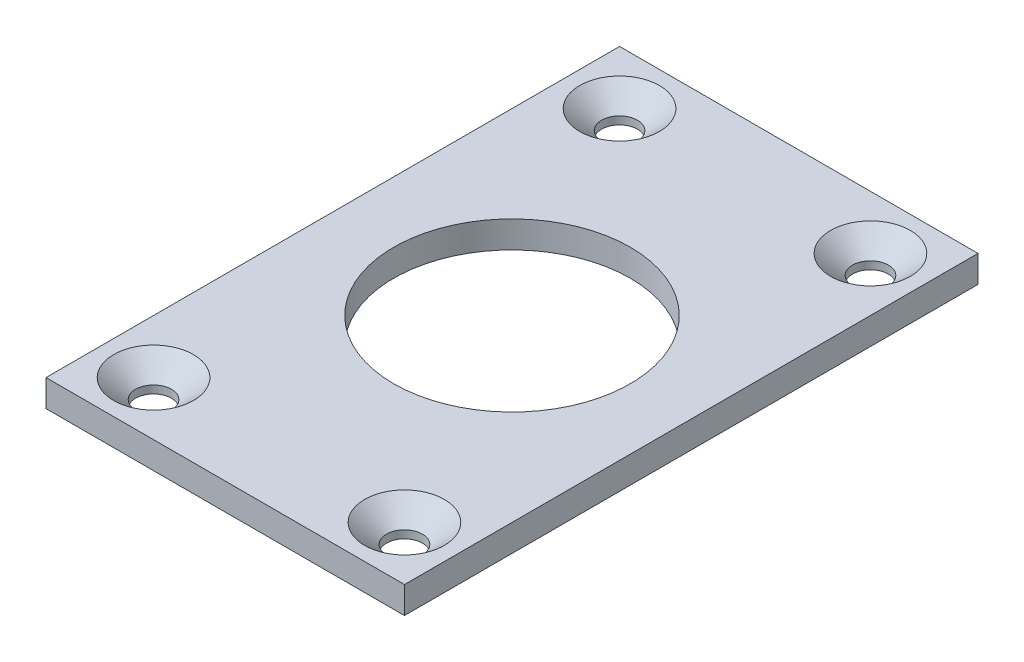
ISO-10303-21;
HEADER;
FILE_DESCRIPTION(('STEP AP214'),'2;1');
FILE_NAME('part.step','',(''),(''),'','','');
FILE_SCHEMA(('AUTOMOTIVE_DESIGN { 1 0 10303 214 1 1 1 1 }'));
ENDSEC;
DATA;
#1=APPLICATION_CONTEXT('core data for automotive mechanical design processes');
#2=APPLICATION_PROTOCOL_DEFINITION('international standard','automotive_design',2000,#1);
#3=PRODUCT_CONTEXT('',#1,'mechanical');
#4=PRODUCT('Part','Part','',(#3));
#5=PRODUCT_RELATED_PRODUCT_CATEGORY('part','',(#4));
#6=PRODUCT_DEFINITION_FORMATION('','',#4);
#7=PRODUCT_DEFINITION_CONTEXT('part definition',#1,'design');
#8=PRODUCT_DEFINITION('design','',#6,#7);
#9=PRODUCT_DEFINITION_SHAPE('','',#8);
#10=(LENGTH_UNIT() NAMED_UNIT(*) SI_UNIT(.MILLI.,.METRE.));
#11=(NAMED_UNIT(*) PLANE_ANGLE_UNIT() SI_UNIT($,.RADIAN.));
#12=(NAMED_UNIT(*) SI_UNIT($,.STERADIAN.) SOLID_ANGLE_UNIT());
#13=UNCERTAINTY_MEASURE_WITH_UNIT(LENGTH_MEASURE(1.E-05),#10,'distance_accuracy_value','');
#14=(GEOMETRIC_REPRESENTATION_CONTEXT(3) GLOBAL_UNCERTAINTY_ASSIGNED_CONTEXT((#13)) GLOBAL_UNIT_ASSIGNED_CONTEXT((#10,
#11,#12)) REPRESENTATION_CONTEXT('',''));
#15=CARTESIAN_POINT('',(0.,0.,0.));
#16=DIRECTION('',(0.,0.,1.));
#17=DIRECTION('',(1.,0.,0.));
#18=AXIS2_PLACEMENT_3D('',#15,#16,#17);
#19=CARTESIAN_POINT('',(0.,4.7625,0.));
#20=DIRECTION('',(0.,-1.,0.));
#21=DIRECTION('',(0.,0.,-1.));
#22=AXIS2_PLACEMENT_3D('',#19,#20,#21);
#23=PLANE('',#22);
#24=CARTESIAN_POINT('',(53.975,4.7625,-9.52500000000001));
#25=DIRECTION('',(0.,-1.,0.));
#26=DIRECTION('',(0.,0.,-1.));
#27=AXIS2_PLACEMENT_3D('',#24,#25,#26);
#28=CIRCLE('',#27,7.06120000000006);
#29=CARTESIAN_POINT('',(53.975,4.7625,-16.5862000000001));
#30=VERTEX_POINT('',#29);
#31=EDGE_CURVE('E147',#30,#30,#28,.T.);
#32=ORIENTED_EDGE('',*,*,#31,.T.);
#33=EDGE_LOOP('',(#32));
#34=FACE_BOUND('',#33,.T.);
#35=CARTESIAN_POINT('',(9.525,4.7625,-9.52500000000001));
#36=DIRECTION('',(0.,-1.,0.));
#37=DIRECTION('',(0.,0.,-1.));
#38=AXIS2_PLACEMENT_3D('',#35,#36,#37);
#39=CIRCLE('',#38,7.06120000000007);
#40=CARTESIAN_POINT('',(9.525,4.7625,-16.5862000000001));
#41=VERTEX_POINT('',#40);
#42=EDGE_CURVE('E143',#41,#41,#39,.T.);
#43=ORIENTED_EDGE('',*,*,#42,.T.);
#44=EDGE_LOOP('',(#43));
#45=FACE_BOUND('',#44,.T.);
#46=CARTESIAN_POINT('',(53.975,4.7625,-92.075));
#47=DIRECTION('',(0.,-1.,0.));
#48=DIRECTION('',(0.,0.,-1.));
#49=AXIS2_PLACEMENT_3D('',#46,#47,#48);
#50=CIRCLE('',#49,7.06120000000006);
#51=CARTESIAN_POINT('',(53.975,4.7625,-99.1362));
#52=VERTEX_POINT('',#51);
#53=EDGE_CURVE('E139',#52,#52,#50,.T.);
#54=ORIENTED_EDGE('',*,*,#53,.T.);
#55=EDGE_LOOP('',(#54));
#56=FACE_BOUND('',#55,.T.);
#57=CARTESIAN_POINT('',(9.525,4.7625,-92.075));
#58=DIRECTION('',(0.,-1.,0.));
#59=DIRECTION('',(0.,0.,-1.));
#60=AXIS2_PLACEMENT_3D('',#57,#58,#59);
#61=CIRCLE('',#60,7.06120000000006);
#62=CARTESIAN_POINT('',(9.525,4.7625,-99.1362));
#63=VERTEX_POINT('',#62);
#64=EDGE_CURVE('E135',#63,#63,#61,.T.);
#65=ORIENTED_EDGE('',*,*,#64,.T.);
#66=EDGE_LOOP('',(#65));
#67=FACE_BOUND('',#66,.T.);
#68=DIRECTION('',(0.,0.,1.));
#69=VECTOR('',#68,1.);
#70=CARTESIAN_POINT('',(0.,4.7625,0.));
#71=LINE('',#70,#69);
#72=CARTESIAN_POINT('',(0.,4.7625,-101.6));
#73=VERTEX_POINT('',#72);
#74=CARTESIAN_POINT('',(0.,4.7625,0.));
#75=VERTEX_POINT('',#74);
#76=EDGE_CURVE('E95',#73,#75,#71,.T.);
#77=ORIENTED_EDGE('',*,*,#76,.T.);
#78=DIRECTION('',(1.,0.,0.));
#79=VECTOR('',#78,1.);
#80=CARTESIAN_POINT('',(0.,4.7625,0.));
#81=LINE('',#80,#79);
#82=CARTESIAN_POINT('',(63.5,4.7625,0.));
#83=VERTEX_POINT('',#82);
#84=EDGE_CURVE('E90',#75,#83,#81,.T.);
#85=ORIENTED_EDGE('',*,*,#84,.T.);
#86=DIRECTION('',(0.,0.,-1.));
#87=VECTOR('',#86,1.);
#88=CARTESIAN_POINT('',(63.5,4.7625,0.));
#89=LINE('',#88,#87);
#90=CARTESIAN_POINT('',(63.5,4.7625,-101.6));
#91=VERTEX_POINT('',#90);
#92=EDGE_CURVE('E93',#83,#91,#89,.T.);
#93=ORIENTED_EDGE('',*,*,#92,.T.);
#94=DIRECTION('',(-1.,0.,0.));
#95=VECTOR('',#94,1.);
#96=CARTESIAN_POINT('',(0.,4.7625,-101.6));
#97=LINE('',#96,#95);
#98=EDGE_CURVE('E59',#91,#73,#97,.T.);
#99=ORIENTED_EDGE('',*,*,#98,.T.);
#100=EDGE_LOOP('',(#77,#85,#93,#99));
#101=FACE_BOUND('',#100,.T.);
#102=CARTESIAN_POINT('',(31.75,4.7625,-50.8));
#103=DIRECTION('',(0.,1.,0.));
#104=DIRECTION('',(0.,0.,1.));
#105=AXIS2_PLACEMENT_3D('',#102,#103,#104);
#106=CIRCLE('',#105,20.955);
#107=CARTESIAN_POINT('',(31.75,4.7625,-29.845));
#108=VERTEX_POINT('',#107);
#109=EDGE_CURVE('E118',#108,#108,#106,.T.);
#110=ORIENTED_EDGE('',*,*,#109,.F.);
#111=EDGE_LOOP('',(#110));
#112=FACE_BOUND('',#111,.T.);
#113=ADVANCED_FACE('F41',(#34,#45,#56,#67,#101,#112),#23,.F.);
#114=CARTESIAN_POINT('',(0.,0.,0.));
#115=DIRECTION('',(0.,-1.,0.));
#116=DIRECTION('',(0.,0.,-1.));
#117=AXIS2_PLACEMENT_3D('',#114,#115,#116);
#118=PLANE('',#117);
#119=CARTESIAN_POINT('',(53.975,0.,-9.52500000000001));
#120=DIRECTION('',(0.,1.,0.));
#121=DIRECTION('',(0.,0.,1.));
#122=AXIS2_PLACEMENT_3D('',#119,#120,#121);
#123=CIRCLE('',#122,3.175);
#124=CARTESIAN_POINT('',(53.975,0.,-6.35));
#125=VERTEX_POINT('',#124);
#126=EDGE_CURVE('E217',#125,#125,#123,.T.);
#127=ORIENTED_EDGE('',*,*,#126,.T.);
#128=EDGE_LOOP('',(#127));
#129=FACE_BOUND('',#128,.T.);
#130=CARTESIAN_POINT('',(9.525,0.,-92.075));
#131=DIRECTION('',(0.,1.,0.));
#132=DIRECTION('',(0.,0.,1.));
#133=AXIS2_PLACEMENT_3D('',#130,#131,#132);
#134=CIRCLE('',#133,3.175);
#135=CARTESIAN_POINT('',(9.525,0.,-88.9));
#136=VERTEX_POINT('',#135);
#137=EDGE_CURVE('E225',#136,#136,#134,.T.);
#138=ORIENTED_EDGE('',*,*,#137,.T.);
#139=EDGE_LOOP('',(#138));
#140=FACE_BOUND('',#139,.T.);
#141=DIRECTION('',(0.,0.,1.));
#142=VECTOR('',#141,1.);
#143=CARTESIAN_POINT('',(0.,0.,0.));
#144=LINE('',#143,#142);
#145=CARTESIAN_POINT('',(0.,0.,-101.6));
#146=VERTEX_POINT('',#145);
#147=CARTESIAN_POINT('',(0.,0.,0.));
#148=VERTEX_POINT('',#147);
#149=EDGE_CURVE('E114',#146,#148,#144,.T.);
#150=ORIENTED_EDGE('',*,*,#149,.F.);
#151=DIRECTION('',(-1.,0.,0.));
#152=VECTOR('',#151,1.);
#153=CARTESIAN_POINT('',(0.,0.,-101.6));
#154=LINE('',#153,#152);
#155=CARTESIAN_POINT('',(63.5,0.,-101.6));
#156=VERTEX_POINT('',#155);
#157=EDGE_CURVE('E82',#156,#146,#154,.T.);
#158=ORIENTED_EDGE('',*,*,#157,.F.);
#159=DIRECTION('',(0.,0.,-1.));
#160=VECTOR('',#159,1.);
#161=CARTESIAN_POINT('',(63.5,0.,0.));
#162=LINE('',#161,#160);
#163=CARTESIAN_POINT('',(63.5,0.,0.));
#164=VERTEX_POINT('',#163);
#165=EDGE_CURVE('E76',#164,#156,#162,.T.);
#166=ORIENTED_EDGE('',*,*,#165,.F.);
#167=DIRECTION('',(1.,0.,0.));
#168=VECTOR('',#167,1.);
#169=CARTESIAN_POINT('',(0.,0.,0.));
#170=LINE('',#169,#168);
#171=EDGE_CURVE('E101',#148,#164,#170,.T.);
#172=ORIENTED_EDGE('',*,*,#171,.F.);
#173=EDGE_LOOP('',(#150,#158,#166,#172));
#174=FACE_BOUND('',#173,.T.);
#175=CARTESIAN_POINT('',(31.75,0.,-50.8));
#176=DIRECTION('',(0.,1.,0.));
#177=DIRECTION('',(0.,0.,1.));
#178=AXIS2_PLACEMENT_3D('',#175,#176,#177);
#179=CIRCLE('',#178,20.955);
#180=CARTESIAN_POINT('',(31.75,0.,-29.845));
#181=VERTEX_POINT('',#180);
#182=EDGE_CURVE('E233',#181,#181,#179,.T.);
#183=ORIENTED_EDGE('',*,*,#182,.T.);
#184=EDGE_LOOP('',(#183));
#185=FACE_BOUND('',#184,.T.);
#186=CARTESIAN_POINT('',(53.975,0.,-92.075));
#187=DIRECTION('',(0.,1.,0.));
#188=DIRECTION('',(0.,0.,-1.));
#189=AXIS2_PLACEMENT_3D('',#186,#187,#188);
#190=CIRCLE('',#189,3.175);
#191=CARTESIAN_POINT('',(53.975,0.,-95.25));
#192=VERTEX_POINT('',#191);
#193=EDGE_CURVE('E219',#192,#192,#190,.T.);
#194=ORIENTED_EDGE('',*,*,#193,.T.);
#195=EDGE_LOOP('',(#194));
#196=FACE_BOUND('',#195,.T.);
#197=CARTESIAN_POINT('',(9.525,0.,-9.52500000000001));
#198=DIRECTION('',(0.,1.,0.));
#199=DIRECTION('',(0.,0.,-1.));
#200=AXIS2_PLACEMENT_3D('',#197,#198,#199);
#201=CIRCLE('',#200,3.175);
#202=CARTESIAN_POINT('',(9.525,0.,-12.7));
#203=VERTEX_POINT('',#202);
#204=EDGE_CURVE('E220',#203,#203,#201,.T.);
#205=ORIENTED_EDGE('',*,*,#204,.T.);
#206=EDGE_LOOP('',(#205));
#207=FACE_BOUND('',#206,.T.);
#208=ADVANCED_FACE('F175',(#129,#140,#174,#185,#196,#207),#118,.T.);
#209=CARTESIAN_POINT('',(0.,4.7625,0.));
#210=DIRECTION('',(1.,0.,0.));
#211=DIRECTION('',(0.,0.,-1.));
#212=AXIS2_PLACEMENT_3D('',#209,#210,#211);
#213=PLANE('',#212);
#214=ORIENTED_EDGE('',*,*,#149,.T.);
#215=DIRECTION('',(0.,-1.,0.));
#216=VECTOR('',#215,1.);
#217=CARTESIAN_POINT('',(0.,4.7625,0.));
#218=LINE('',#217,#216);
#219=EDGE_CURVE('E103',#75,#148,#218,.T.);
#220=ORIENTED_EDGE('',*,*,#219,.F.);
#221=ORIENTED_EDGE('',*,*,#76,.F.);
#222=DIRECTION('',(0.,-1.,0.));
#223=VECTOR('',#222,1.);
#224=CARTESIAN_POINT('',(0.,4.7625,-101.6));
#225=LINE('',#224,#223);
#226=EDGE_CURVE('E110',#73,#146,#225,.T.);
#227=ORIENTED_EDGE('',*,*,#226,.T.);
#228=EDGE_LOOP('',(#214,#220,#221,#227));
#229=FACE_BOUND('',#228,.T.);
#230=ADVANCED_FACE('F181',(#229),#213,.F.);
#231=CARTESIAN_POINT('',(0.,4.7625,0.));
#232=DIRECTION('',(0.,0.,-1.));
#233=DIRECTION('',(-1.,0.,0.));
#234=AXIS2_PLACEMENT_3D('',#231,#232,#233);
#235=PLANE('',#234);
#236=ORIENTED_EDGE('',*,*,#171,.T.);
#237=DIRECTION('',(0.,-1.,0.));
#238=VECTOR('',#237,1.);
#239=CARTESIAN_POINT('',(63.5,4.7625,0.));
#240=LINE('',#239,#238);
#241=EDGE_CURVE('E99',#83,#164,#240,.T.);
#242=ORIENTED_EDGE('',*,*,#241,.F.);
#243=ORIENTED_EDGE('',*,*,#84,.F.);
#244=ORIENTED_EDGE('',*,*,#219,.T.);
#245=EDGE_LOOP('',(#236,#242,#243,#244));
#246=FACE_BOUND('',#245,.T.);
#247=ADVANCED_FACE('F100',(#246),#235,.F.);
#248=CARTESIAN_POINT('',(63.5,4.7625,0.));
#249=DIRECTION('',(-1.,0.,0.));
#250=DIRECTION('',(0.,0.,1.));
#251=AXIS2_PLACEMENT_3D('',#248,#249,#250);
#252=PLANE('',#251);
#253=ORIENTED_EDGE('',*,*,#165,.T.);
#254=DIRECTION('',(0.,-1.,0.));
#255=VECTOR('',#254,1.);
#256=CARTESIAN_POINT('',(63.5,4.7625,-101.6));
#257=LINE('',#256,#255);
#258=EDGE_CURVE('E104',#91,#156,#257,.T.);
#259=ORIENTED_EDGE('',*,*,#258,.F.);
#260=ORIENTED_EDGE('',*,*,#92,.F.);
#261=ORIENTED_EDGE('',*,*,#241,.T.);
#262=EDGE_LOOP('',(#253,#259,#260,#261));
#263=FACE_BOUND('',#262,.T.);
#264=ADVANCED_FACE('F106',(#263),#252,.F.);
#265=CARTESIAN_POINT('',(0.,4.7625,-101.6));
#266=DIRECTION('',(0.,0.,1.));
#267=DIRECTION('',(1.,0.,0.));
#268=AXIS2_PLACEMENT_3D('',#265,#266,#267);
#269=PLANE('',#268);
#270=ORIENTED_EDGE('',*,*,#157,.T.);
#271=ORIENTED_EDGE('',*,*,#226,.F.);
#272=ORIENTED_EDGE('',*,*,#98,.F.);
#273=ORIENTED_EDGE('',*,*,#258,.T.);
#274=EDGE_LOOP('',(#270,#271,#272,#273));
#275=FACE_BOUND('',#274,.T.);
#276=ADVANCED_FACE('F189',(#275),#269,.F.);
#277=CARTESIAN_POINT('',(31.75,4.7625,-50.8));
#278=DIRECTION('',(0.,-1.,0.));
#279=DIRECTION('',(0.,0.,-1.));
#280=AXIS2_PLACEMENT_3D('',#277,#278,#279);
#281=CYLINDRICAL_SURFACE('',#280,20.955);
#282=ORIENTED_EDGE('',*,*,#109,.T.);
#283=EDGE_LOOP('',(#282));
#284=FACE_BOUND('',#283,.T.);
#285=ORIENTED_EDGE('',*,*,#182,.F.);
#286=EDGE_LOOP('',(#285));
#287=FACE_BOUND('',#286,.T.);
#288=ADVANCED_FACE('F186',(#284,#287),#281,.F.);
#289=CARTESIAN_POINT('',(9.525,4.7625,-92.075));
#290=DIRECTION('',(0.,-1.,0.));
#291=DIRECTION('',(0.,0.,-1.));
#292=AXIS2_PLACEMENT_3D('',#289,#290,#291);
#293=CYLINDRICAL_SURFACE('',#292,3.175);
#294=CARTESIAN_POINT('',(9.525,1.38427787949855,-92.075));
#295=DIRECTION('',(0.,-1.,0.));
#296=DIRECTION('',(0.,0.,-1.));
#297=AXIS2_PLACEMENT_3D('',#294,#295,#296);
#298=CIRCLE('',#297,3.175);
#299=CARTESIAN_POINT('',(9.525,1.38427787949855,-95.25));
#300=VERTEX_POINT('',#299);
#301=EDGE_CURVE('E11',#300,#300,#298,.F.);
#302=ORIENTED_EDGE('',*,*,#301,.T.);
#303=EDGE_LOOP('',(#302));
#304=FACE_BOUND('',#303,.T.);
#305=ORIENTED_EDGE('',*,*,#137,.F.);
#306=EDGE_LOOP('',(#305));
#307=FACE_BOUND('',#306,.T.);
#308=ADVANCED_FACE('F245',(#304,#307),#293,.F.);
#309=CARTESIAN_POINT('',(53.975,4.7625,-92.075));
#310=DIRECTION('',(0.,-1.,0.));
#311=DIRECTION('',(0.,0.,-1.));
#312=AXIS2_PLACEMENT_3D('',#309,#310,#311);
#313=CYLINDRICAL_SURFACE('',#312,3.175);
#314=CARTESIAN_POINT('',(53.975,1.38427787949856,-92.075));
#315=DIRECTION('',(0.,-1.,0.));
#316=DIRECTION('',(0.,0.,-1.));
#317=AXIS2_PLACEMENT_3D('',#314,#315,#316);
#318=CIRCLE('',#317,3.175);
#319=CARTESIAN_POINT('',(53.975,1.38427787949856,-95.25));
#320=VERTEX_POINT('',#319);
#321=EDGE_CURVE('E51',#320,#320,#318,.F.);
#322=ORIENTED_EDGE('',*,*,#321,.T.);
#323=EDGE_LOOP('',(#322));
#324=FACE_BOUND('',#323,.T.);
#325=ORIENTED_EDGE('',*,*,#193,.F.);
#326=EDGE_LOOP('',(#325));
#327=FACE_BOUND('',#326,.T.);
#328=ADVANCED_FACE('F158',(#324,#327),#313,.F.);
#329=CARTESIAN_POINT('',(53.975,4.7625,-9.52500000000001));
#330=DIRECTION('',(0.,-1.,0.));
#331=DIRECTION('',(0.,0.,-1.));
#332=AXIS2_PLACEMENT_3D('',#329,#330,#331);
#333=CYLINDRICAL_SURFACE('',#332,3.175);
#334=CARTESIAN_POINT('',(53.975,1.38427787949856,-9.52500000000001));
#335=DIRECTION('',(0.,-1.,0.));
#336=DIRECTION('',(0.,0.,-1.));
#337=AXIS2_PLACEMENT_3D('',#334,#335,#336);
#338=CIRCLE('',#337,3.175);
#339=CARTESIAN_POINT('',(53.975,1.38427787949856,-12.7));
#340=VERTEX_POINT('',#339);
#341=EDGE_CURVE('E131',#340,#340,#338,.F.);
#342=ORIENTED_EDGE('',*,*,#341,.T.);
#343=EDGE_LOOP('',(#342));
#344=FACE_BOUND('',#343,.T.);
#345=ORIENTED_EDGE('',*,*,#126,.F.);
#346=EDGE_LOOP('',(#345));
#347=FACE_BOUND('',#346,.T.);
#348=ADVANCED_FACE('F205',(#344,#347),#333,.F.);
#349=CARTESIAN_POINT('',(9.525,4.7625,-9.52500000000001));
#350=DIRECTION('',(0.,-1.,0.));
#351=DIRECTION('',(0.,0.,-1.));
#352=AXIS2_PLACEMENT_3D('',#349,#350,#351);
#353=CYLINDRICAL_SURFACE('',#352,3.175);
#354=CARTESIAN_POINT('',(9.525,1.38427787949854,-9.52500000000001));
#355=DIRECTION('',(0.,-1.,0.));
#356=DIRECTION('',(0.,0.,-1.));
#357=AXIS2_PLACEMENT_3D('',#354,#355,#356);
#358=CIRCLE('',#357,3.175);
#359=CARTESIAN_POINT('',(9.525,1.38427787949854,-12.7));
#360=VERTEX_POINT('',#359);
#361=EDGE_CURVE('E151',#360,#360,#358,.F.);
#362=ORIENTED_EDGE('',*,*,#361,.T.);
#363=EDGE_LOOP('',(#362));
#364=FACE_BOUND('',#363,.T.);
#365=ORIENTED_EDGE('',*,*,#204,.F.);
#366=EDGE_LOOP('',(#365));
#367=FACE_BOUND('',#366,.T.);
#368=ADVANCED_FACE('F200',(#364,#367),#353,.F.);
#369=CARTESIAN_POINT('',(53.975,1.38427787949856,-9.52500000000001));
#370=DIRECTION('',(0.,1.,0.));
#371=DIRECTION('',(0.,0.,1.));
#372=AXIS2_PLACEMENT_3D('',#369,#370,#371);
#373=CONICAL_SURFACE('',#372,3.175,0.855211333477225);
#374=ORIENTED_EDGE('',*,*,#31,.F.);
#375=EDGE_LOOP('',(#374));
#376=FACE_BOUND('',#375,.T.);
#377=ORIENTED_EDGE('',*,*,#341,.F.);
#378=EDGE_LOOP('',(#377));
#379=FACE_BOUND('',#378,.T.);
#380=ADVANCED_FACE('F170',(#376,#379),#373,.F.);
#381=CARTESIAN_POINT('',(9.525,1.38427787949854,-9.52500000000001));
#382=DIRECTION('',(0.,1.,0.));
#383=DIRECTION('',(0.,0.,1.));
#384=AXIS2_PLACEMENT_3D('',#381,#382,#383);
#385=CONICAL_SURFACE('',#384,3.175,0.855211333477225);
#386=ORIENTED_EDGE('',*,*,#42,.F.);
#387=EDGE_LOOP('',(#386));
#388=FACE_BOUND('',#387,.T.);
#389=ORIENTED_EDGE('',*,*,#361,.F.);
#390=EDGE_LOOP('',(#389));
#391=FACE_BOUND('',#390,.T.);
#392=ADVANCED_FACE('F163',(#388,#391),#385,.F.);
#393=CARTESIAN_POINT('',(53.975,1.38427787949856,-92.075));
#394=DIRECTION('',(0.,1.,0.));
#395=DIRECTION('',(0.,0.,1.));
#396=AXIS2_PLACEMENT_3D('',#393,#394,#395);
#397=CONICAL_SURFACE('',#396,3.175,0.855211333477225);
#398=ORIENTED_EDGE('',*,*,#53,.F.);
#399=EDGE_LOOP('',(#398));
#400=FACE_BOUND('',#399,.T.);
#401=ORIENTED_EDGE('',*,*,#321,.F.);
#402=EDGE_LOOP('',(#401));
#403=FACE_BOUND('',#402,.T.);
#404=ADVANCED_FACE('F161',(#400,#403),#397,.F.);
#405=CARTESIAN_POINT('',(9.525,1.38427787949855,-92.075));
#406=DIRECTION('',(0.,1.,0.));
#407=DIRECTION('',(0.,0.,1.));
#408=AXIS2_PLACEMENT_3D('',#405,#406,#407);
#409=CONICAL_SURFACE('',#408,3.175,0.855211333477225);
#410=ORIENTED_EDGE('',*,*,#64,.F.);
#411=EDGE_LOOP('',(#410));
#412=FACE_BOUND('',#411,.T.);
#413=ORIENTED_EDGE('',*,*,#301,.F.);
#414=EDGE_LOOP('',(#413));
#415=FACE_BOUND('',#414,.T.);
#416=ADVANCED_FACE('F43',(#412,#415),#409,.F.);
#417=CLOSED_SHELL('',(#113,#208,#230,#247,#264,#276,#288,#308,#328,#348,#368,#380,#392,#404,#416));
#418=MANIFOLD_SOLID_BREP('B2',#417);
#419=ADVANCED_BREP_SHAPE_REPRESENTATION('',(#18,#418),#14);
#420=SHAPE_DEFINITION_REPRESENTATION(#9,#419);
ENDSEC;
END-ISO-10303-21;
